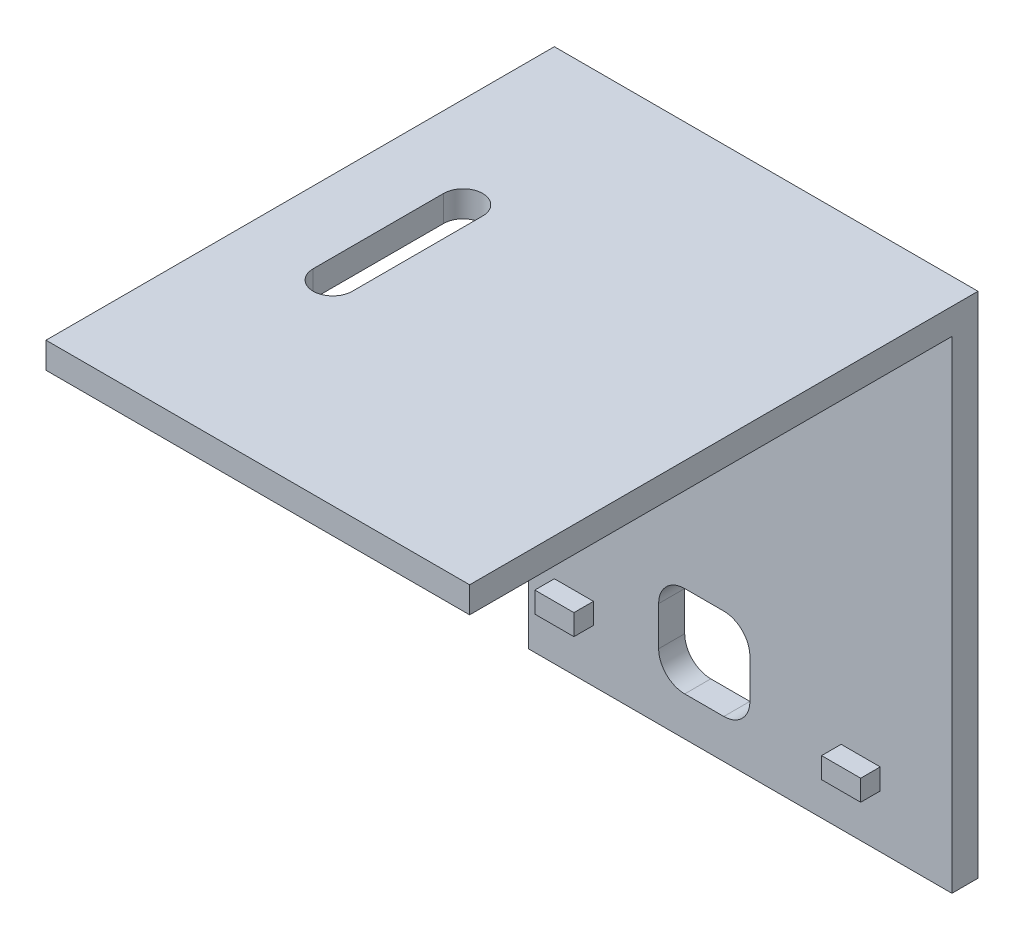
ISO-10303-21;
HEADER;
FILE_DESCRIPTION(('STEP AP214'),'2;1');
FILE_NAME('part.step','',(''),(''),'','','');
FILE_SCHEMA(('AUTOMOTIVE_DESIGN { 1 0 10303 214 1 1 1 1 }'));
ENDSEC;
DATA;
#1=APPLICATION_CONTEXT('core data for automotive mechanical design processes');
#2=APPLICATION_PROTOCOL_DEFINITION('international standard','automotive_design',2000,#1);
#3=PRODUCT_CONTEXT('',#1,'mechanical');
#4=PRODUCT('Part','Part','',(#3));
#5=PRODUCT_RELATED_PRODUCT_CATEGORY('part','',(#4));
#6=PRODUCT_DEFINITION_FORMATION('','',#4);
#7=PRODUCT_DEFINITION_CONTEXT('part definition',#1,'design');
#8=PRODUCT_DEFINITION('design','',#6,#7);
#9=PRODUCT_DEFINITION_SHAPE('','',#8);
#10=(LENGTH_UNIT() NAMED_UNIT(*) SI_UNIT(.MILLI.,.METRE.));
#11=(NAMED_UNIT(*) PLANE_ANGLE_UNIT() SI_UNIT($,.RADIAN.));
#12=(NAMED_UNIT(*) SI_UNIT($,.STERADIAN.) SOLID_ANGLE_UNIT());
#13=UNCERTAINTY_MEASURE_WITH_UNIT(LENGTH_MEASURE(1.E-05),#10,'distance_accuracy_value','');
#14=(GEOMETRIC_REPRESENTATION_CONTEXT(3) GLOBAL_UNCERTAINTY_ASSIGNED_CONTEXT((#13)) GLOBAL_UNIT_ASSIGNED_CONTEXT((#10,
#11,#12)) REPRESENTATION_CONTEXT('',''));
#15=CARTESIAN_POINT('',(0.,0.,0.));
#16=DIRECTION('',(0.,0.,1.));
#17=DIRECTION('',(1.,0.,0.));
#18=AXIS2_PLACEMENT_3D('',#15,#16,#17);
#19=CARTESIAN_POINT('',(0.,0.,2.));
#20=DIRECTION('',(0.,0.,-1.));
#21=DIRECTION('',(-1.,0.,0.));
#22=AXIS2_PLACEMENT_3D('',#19,#20,#21);
#23=PLANE('',#22);
#24=DIRECTION('',(0.,1.,0.));
#25=VECTOR('',#24,1.);
#26=CARTESIAN_POINT('',(-6.25000000000001,0.,2.));
#27=LINE('',#26,#25);
#28=CARTESIAN_POINT('',(-6.25,-13.5,2.));
#29=VERTEX_POINT('',#28);
#30=CARTESIAN_POINT('',(-6.25,-10.5,2.));
#31=VERTEX_POINT('',#30);
#32=EDGE_CURVE('E282',#29,#31,#27,.T.);
#33=ORIENTED_EDGE('',*,*,#32,.T.);
#34=CARTESIAN_POINT('',(-4.25,-10.5,2.));
#35=DIRECTION('',(0.,0.,-1.));
#36=DIRECTION('',(-1.,0.,0.));
#37=AXIS2_PLACEMENT_3D('',#34,#35,#36);
#38=CIRCLE('',#37,2.);
#39=CARTESIAN_POINT('',(-4.25,-8.50000000000001,2.));
#40=VERTEX_POINT('',#39);
#41=EDGE_CURVE('E409',#31,#40,#38,.T.);
#42=ORIENTED_EDGE('',*,*,#41,.T.);
#43=DIRECTION('',(1.,0.,0.));
#44=VECTOR('',#43,1.);
#45=CARTESIAN_POINT('',(0.,-8.50000000000001,2.));
#46=LINE('',#45,#44);
#47=CARTESIAN_POINT('',(-1.25,-8.50000000000001,2.));
#48=VERTEX_POINT('',#47);
#49=EDGE_CURVE('E285',#40,#48,#46,.T.);
#50=ORIENTED_EDGE('',*,*,#49,.T.);
#51=CARTESIAN_POINT('',(-1.25,-10.5,2.));
#52=DIRECTION('',(0.,0.,-1.));
#53=DIRECTION('',(-1.,0.,0.));
#54=AXIS2_PLACEMENT_3D('',#51,#52,#53);
#55=CIRCLE('',#54,2.);
#56=CARTESIAN_POINT('',(0.749999999999995,-10.5,2.));
#57=VERTEX_POINT('',#56);
#58=EDGE_CURVE('E11',#48,#57,#55,.T.);
#59=ORIENTED_EDGE('',*,*,#58,.T.);
#60=DIRECTION('',(0.,-1.,0.));
#61=VECTOR('',#60,1.);
#62=CARTESIAN_POINT('',(0.749999999999995,0.,2.));
#63=LINE('',#62,#61);
#64=CARTESIAN_POINT('',(0.749999999999995,-13.5,2.));
#65=VERTEX_POINT('',#64);
#66=EDGE_CURVE('E288',#57,#65,#63,.T.);
#67=ORIENTED_EDGE('',*,*,#66,.T.);
#68=CARTESIAN_POINT('',(-1.25,-13.5,2.));
#69=DIRECTION('',(0.,0.,-1.));
#70=DIRECTION('',(-1.,0.,0.));
#71=AXIS2_PLACEMENT_3D('',#68,#69,#70);
#72=CIRCLE('',#71,2.);
#73=CARTESIAN_POINT('',(-1.25,-15.5,2.));
#74=VERTEX_POINT('',#73);
#75=EDGE_CURVE('E405',#65,#74,#72,.T.);
#76=ORIENTED_EDGE('',*,*,#75,.T.);
#77=DIRECTION('',(-1.,0.,0.));
#78=VECTOR('',#77,1.);
#79=CARTESIAN_POINT('',(0.,-15.5,2.));
#80=LINE('',#79,#78);
#81=CARTESIAN_POINT('',(-4.25,-15.5,2.));
#82=VERTEX_POINT('',#81);
#83=EDGE_CURVE('E279',#74,#82,#80,.T.);
#84=ORIENTED_EDGE('',*,*,#83,.T.);
#85=CARTESIAN_POINT('',(-4.25,-13.5,2.));
#86=DIRECTION('',(0.,0.,-1.));
#87=DIRECTION('',(-1.,0.,0.));
#88=AXIS2_PLACEMENT_3D('',#85,#86,#87);
#89=CIRCLE('',#88,2.);
#90=EDGE_CURVE('E401',#82,#29,#89,.T.);
#91=ORIENTED_EDGE('',*,*,#90,.T.);
#92=EDGE_LOOP('',(#33,#42,#50,#59,#67,#76,#84,#91));
#93=FACE_BOUND('',#92,.T.);
#94=DIRECTION('',(0.,-1.,0.));
#95=VECTOR('',#94,1.);
#96=CARTESIAN_POINT('',(-14.25,-12.85,2.));
#97=LINE('',#96,#95);
#98=CARTESIAN_POINT('',(-14.25,-12.85,2.));
#99=VERTEX_POINT('',#98);
#100=CARTESIAN_POINT('',(-14.25,-14.45,2.));
#101=VERTEX_POINT('',#100);
#102=EDGE_CURVE('E324',#99,#101,#97,.T.);
#103=ORIENTED_EDGE('',*,*,#102,.F.);
#104=DIRECTION('',(-1.,0.,0.));
#105=VECTOR('',#104,1.);
#106=CARTESIAN_POINT('',(-14.25,-12.85,2.));
#107=LINE('',#106,#105);
#108=CARTESIAN_POINT('',(-11.25,-12.85,2.));
#109=VERTEX_POINT('',#108);
#110=EDGE_CURVE('E329',#109,#99,#107,.T.);
#111=ORIENTED_EDGE('',*,*,#110,.F.);
#112=DIRECTION('',(0.,1.,0.));
#113=VECTOR('',#112,1.);
#114=CARTESIAN_POINT('',(-11.25,-12.85,2.));
#115=LINE('',#114,#113);
#116=CARTESIAN_POINT('',(-11.25,-14.45,2.));
#117=VERTEX_POINT('',#116);
#118=EDGE_CURVE('E341',#117,#109,#115,.T.);
#119=ORIENTED_EDGE('',*,*,#118,.F.);
#120=DIRECTION('',(1.,0.,0.));
#121=VECTOR('',#120,1.);
#122=CARTESIAN_POINT('',(-14.25,-14.45,2.));
#123=LINE('',#122,#121);
#124=EDGE_CURVE('E338',#101,#117,#123,.T.);
#125=ORIENTED_EDGE('',*,*,#124,.F.);
#126=EDGE_LOOP('',(#103,#111,#119,#125));
#127=FACE_BOUND('',#126,.T.);
#128=DIRECTION('',(0.,1.,0.));
#129=VECTOR('',#128,1.);
#130=CARTESIAN_POINT('',(16.25,-18.5,2.));
#131=LINE('',#130,#129);
#132=CARTESIAN_POINT('',(16.25,-18.5,2.));
#133=VERTEX_POINT('',#132);
#134=CARTESIAN_POINT('',(16.25,18.5,2.));
#135=VERTEX_POINT('',#134);
#136=EDGE_CURVE('E358',#133,#135,#131,.T.);
#137=ORIENTED_EDGE('',*,*,#136,.T.);
#138=DIRECTION('',(-1.,0.,0.));
#139=VECTOR('',#138,1.);
#140=CARTESIAN_POINT('',(-16.25,18.5,2.));
#141=LINE('',#140,#139);
#142=CARTESIAN_POINT('',(-16.25,18.5,2.));
#143=VERTEX_POINT('',#142);
#144=EDGE_CURVE('E361',#135,#143,#141,.T.);
#145=ORIENTED_EDGE('',*,*,#144,.T.);
#146=DIRECTION('',(0.,-1.,0.));
#147=VECTOR('',#146,1.);
#148=CARTESIAN_POINT('',(-16.25,-18.5,2.));
#149=LINE('',#148,#147);
#150=CARTESIAN_POINT('',(-16.25,-18.5,2.));
#151=VERTEX_POINT('',#150);
#152=EDGE_CURVE('E365',#143,#151,#149,.T.);
#153=ORIENTED_EDGE('',*,*,#152,.T.);
#154=DIRECTION('',(1.,0.,0.));
#155=VECTOR('',#154,1.);
#156=CARTESIAN_POINT('',(-16.25,-18.5,2.));
#157=LINE('',#156,#155);
#158=EDGE_CURVE('E367',#151,#133,#157,.T.);
#159=ORIENTED_EDGE('',*,*,#158,.T.);
#160=EDGE_LOOP('',(#137,#145,#153,#159));
#161=FACE_BOUND('',#160,.T.);
#162=DIRECTION('',(0.,1.,0.));
#163=VECTOR('',#162,1.);
#164=CARTESIAN_POINT('',(10.75,-14.45,2.));
#165=LINE('',#164,#163);
#166=CARTESIAN_POINT('',(10.75,-14.45,2.));
#167=VERTEX_POINT('',#166);
#168=CARTESIAN_POINT('',(10.75,-12.85,2.));
#169=VERTEX_POINT('',#168);
#170=EDGE_CURVE('E291',#167,#169,#165,.T.);
#171=ORIENTED_EDGE('',*,*,#170,.F.);
#172=DIRECTION('',(1.,0.,0.));
#173=VECTOR('',#172,1.);
#174=CARTESIAN_POINT('',(7.75,-14.45,2.));
#175=LINE('',#174,#173);
#176=CARTESIAN_POINT('',(7.75,-14.45,2.));
#177=VERTEX_POINT('',#176);
#178=EDGE_CURVE('E296',#177,#167,#175,.T.);
#179=ORIENTED_EDGE('',*,*,#178,.F.);
#180=DIRECTION('',(0.,-1.,0.));
#181=VECTOR('',#180,1.);
#182=CARTESIAN_POINT('',(7.75,-14.45,2.));
#183=LINE('',#182,#181);
#184=CARTESIAN_POINT('',(7.75,-12.85,2.));
#185=VERTEX_POINT('',#184);
#186=EDGE_CURVE('E308',#185,#177,#183,.T.);
#187=ORIENTED_EDGE('',*,*,#186,.F.);
#188=DIRECTION('',(-1.,0.,0.));
#189=VECTOR('',#188,1.);
#190=CARTESIAN_POINT('',(7.75,-12.85,2.));
#191=LINE('',#190,#189);
#192=EDGE_CURVE('E305',#169,#185,#191,.T.);
#193=ORIENTED_EDGE('',*,*,#192,.F.);
#194=EDGE_LOOP('',(#171,#179,#187,#193));
#195=FACE_BOUND('',#194,.T.);
#196=ADVANCED_FACE('F35',(#93,#127,#161,#195),#23,.F.);
#197=CARTESIAN_POINT('',(16.25,-18.5,2.));
#198=DIRECTION('',(-1.,0.,0.));
#199=DIRECTION('',(0.,0.,1.));
#200=AXIS2_PLACEMENT_3D('',#197,#198,#199);
#201=PLANE('',#200);
#202=DIRECTION('',(0.,1.,0.));
#203=VECTOR('',#202,1.);
#204=CARTESIAN_POINT('',(16.25,-18.5,0.));
#205=LINE('',#204,#203);
#206=CARTESIAN_POINT('',(16.25,-18.5,0.));
#207=VERTEX_POINT('',#206);
#208=CARTESIAN_POINT('',(16.25,20.5,0.));
#209=VERTEX_POINT('',#208);
#210=EDGE_CURVE('E357',#207,#209,#205,.T.);
#211=ORIENTED_EDGE('',*,*,#210,.T.);
#212=DIRECTION('',(0.,0.,-1.));
#213=VECTOR('',#212,1.);
#214=CARTESIAN_POINT('',(16.25,20.5,0.));
#215=LINE('',#214,#213);
#216=CARTESIAN_POINT('',(16.25,20.5,39.));
#217=VERTEX_POINT('',#216);
#218=EDGE_CURVE('E250',#217,#209,#215,.T.);
#219=ORIENTED_EDGE('',*,*,#218,.F.);
#220=DIRECTION('',(0.,-1.,0.));
#221=VECTOR('',#220,1.);
#222=CARTESIAN_POINT('',(16.25,20.5,39.));
#223=LINE('',#222,#221);
#224=CARTESIAN_POINT('',(16.25,18.5,39.));
#225=VERTEX_POINT('',#224);
#226=EDGE_CURVE('E256',#217,#225,#223,.T.);
#227=ORIENTED_EDGE('',*,*,#226,.T.);
#228=DIRECTION('',(0.,0.,-1.));
#229=VECTOR('',#228,1.);
#230=CARTESIAN_POINT('',(16.25,18.5,0.));
#231=LINE('',#230,#229);
#232=EDGE_CURVE('E248',#225,#135,#231,.T.);
#233=ORIENTED_EDGE('',*,*,#232,.T.);
#234=ORIENTED_EDGE('',*,*,#136,.F.);
#235=DIRECTION('',(0.,0.,-1.));
#236=VECTOR('',#235,1.);
#237=CARTESIAN_POINT('',(16.25,-18.5,2.));
#238=LINE('',#237,#236);
#239=EDGE_CURVE('E369',#133,#207,#238,.T.);
#240=ORIENTED_EDGE('',*,*,#239,.T.);
#241=EDGE_LOOP('',(#211,#219,#227,#233,#234,#240));
#242=FACE_BOUND('',#241,.T.);
#243=ADVANCED_FACE('F458',(#242),#201,.F.);
#244=CARTESIAN_POINT('',(-16.25,-18.5,2.));
#245=DIRECTION('',(1.,0.,0.));
#246=DIRECTION('',(0.,0.,-1.));
#247=AXIS2_PLACEMENT_3D('',#244,#245,#246);
#248=PLANE('',#247);
#249=DIRECTION('',(0.,-1.,0.));
#250=VECTOR('',#249,1.);
#251=CARTESIAN_POINT('',(-16.25,-18.5,0.));
#252=LINE('',#251,#250);
#253=CARTESIAN_POINT('',(-16.25,20.5,0.));
#254=VERTEX_POINT('',#253);
#255=CARTESIAN_POINT('',(-16.25,-18.5,0.));
#256=VERTEX_POINT('',#255);
#257=EDGE_CURVE('E371',#254,#256,#252,.T.);
#258=ORIENTED_EDGE('',*,*,#257,.T.);
#259=DIRECTION('',(0.,0.,-1.));
#260=VECTOR('',#259,1.);
#261=CARTESIAN_POINT('',(-16.25,-18.5,2.));
#262=LINE('',#261,#260);
#263=EDGE_CURVE('E376',#151,#256,#262,.T.);
#264=ORIENTED_EDGE('',*,*,#263,.F.);
#265=ORIENTED_EDGE('',*,*,#152,.F.);
#266=DIRECTION('',(0.,0.,1.));
#267=VECTOR('',#266,1.);
#268=CARTESIAN_POINT('',(-16.25,18.5,0.));
#269=LINE('',#268,#267);
#270=CARTESIAN_POINT('',(-16.25,18.5,39.));
#271=VERTEX_POINT('',#270);
#272=EDGE_CURVE('E240',#143,#271,#269,.T.);
#273=ORIENTED_EDGE('',*,*,#272,.T.);
#274=DIRECTION('',(0.,-1.,0.));
#275=VECTOR('',#274,1.);
#276=CARTESIAN_POINT('',(-16.25,20.5,39.));
#277=LINE('',#276,#275);
#278=CARTESIAN_POINT('',(-16.25,20.5,39.));
#279=VERTEX_POINT('',#278);
#280=EDGE_CURVE('E264',#279,#271,#277,.T.);
#281=ORIENTED_EDGE('',*,*,#280,.F.);
#282=DIRECTION('',(0.,0.,1.));
#283=VECTOR('',#282,1.);
#284=CARTESIAN_POINT('',(-16.25,20.5,0.));
#285=LINE('',#284,#283);
#286=EDGE_CURVE('E244',#254,#279,#285,.T.);
#287=ORIENTED_EDGE('',*,*,#286,.F.);
#288=EDGE_LOOP('',(#258,#264,#265,#273,#281,#287));
#289=FACE_BOUND('',#288,.T.);
#290=ADVANCED_FACE('F463',(#289),#248,.F.);
#291=CARTESIAN_POINT('',(-16.25,-18.5,2.));
#292=DIRECTION('',(0.,1.,0.));
#293=DIRECTION('',(0.,0.,1.));
#294=AXIS2_PLACEMENT_3D('',#291,#292,#293);
#295=PLANE('',#294);
#296=DIRECTION('',(1.,0.,0.));
#297=VECTOR('',#296,1.);
#298=CARTESIAN_POINT('',(-16.25,-18.5,0.));
#299=LINE('',#298,#297);
#300=EDGE_CURVE('E362',#256,#207,#299,.T.);
#301=ORIENTED_EDGE('',*,*,#300,.T.);
#302=ORIENTED_EDGE('',*,*,#239,.F.);
#303=ORIENTED_EDGE('',*,*,#158,.F.);
#304=ORIENTED_EDGE('',*,*,#263,.T.);
#305=EDGE_LOOP('',(#301,#302,#303,#304));
#306=FACE_BOUND('',#305,.T.);
#307=ADVANCED_FACE('F472',(#306),#295,.F.);
#308=CARTESIAN_POINT('',(0.,0.,0.));
#309=DIRECTION('',(0.,0.,-1.));
#310=DIRECTION('',(-1.,0.,0.));
#311=AXIS2_PLACEMENT_3D('',#308,#309,#310);
#312=PLANE('',#311);
#313=DIRECTION('',(0.,-1.,0.));
#314=VECTOR('',#313,1.);
#315=CARTESIAN_POINT('',(0.749999999999995,-15.5,0.));
#316=LINE('',#315,#314);
#317=CARTESIAN_POINT('',(0.749999999999995,-10.5,0.));
#318=VERTEX_POINT('',#317);
#319=CARTESIAN_POINT('',(0.749999999999995,-13.5,0.));
#320=VERTEX_POINT('',#319);
#321=EDGE_CURVE('E267',#318,#320,#316,.T.);
#322=ORIENTED_EDGE('',*,*,#321,.F.);
#323=CARTESIAN_POINT('',(-1.25,-10.5,0.));
#324=DIRECTION('',(0.,0.,-1.));
#325=DIRECTION('',(-1.,0.,0.));
#326=AXIS2_PLACEMENT_3D('',#323,#324,#325);
#327=CIRCLE('',#326,2.);
#328=CARTESIAN_POINT('',(-1.25,-8.50000000000001,0.));
#329=VERTEX_POINT('',#328);
#330=EDGE_CURVE('E43',#318,#329,#327,.F.);
#331=ORIENTED_EDGE('',*,*,#330,.T.);
#332=DIRECTION('',(1.,0.,0.));
#333=VECTOR('',#332,1.);
#334=CARTESIAN_POINT('',(0.749999999999995,-8.50000000000001,0.));
#335=LINE('',#334,#333);
#336=CARTESIAN_POINT('',(-4.25,-8.50000000000001,0.));
#337=VERTEX_POINT('',#336);
#338=EDGE_CURVE('E276',#337,#329,#335,.T.);
#339=ORIENTED_EDGE('',*,*,#338,.F.);
#340=CARTESIAN_POINT('',(-4.25,-10.5,0.));
#341=DIRECTION('',(0.,0.,-1.));
#342=DIRECTION('',(-1.,0.,0.));
#343=AXIS2_PLACEMENT_3D('',#340,#341,#342);
#344=CIRCLE('',#343,2.);
#345=CARTESIAN_POINT('',(-6.25,-10.5,0.));
#346=VERTEX_POINT('',#345);
#347=EDGE_CURVE('E407',#337,#346,#344,.F.);
#348=ORIENTED_EDGE('',*,*,#347,.T.);
#349=DIRECTION('',(0.,1.,0.));
#350=VECTOR('',#349,1.);
#351=CARTESIAN_POINT('',(-6.25,-15.5,0.));
#352=LINE('',#351,#350);
#353=CARTESIAN_POINT('',(-6.25,-13.5,0.));
#354=VERTEX_POINT('',#353);
#355=EDGE_CURVE('E273',#354,#346,#352,.T.);
#356=ORIENTED_EDGE('',*,*,#355,.F.);
#357=CARTESIAN_POINT('',(-4.25,-13.5,0.));
#358=DIRECTION('',(0.,0.,-1.));
#359=DIRECTION('',(-1.,0.,0.));
#360=AXIS2_PLACEMENT_3D('',#357,#358,#359);
#361=CIRCLE('',#360,2.);
#362=CARTESIAN_POINT('',(-4.25,-15.5,0.));
#363=VERTEX_POINT('',#362);
#364=EDGE_CURVE('E399',#354,#363,#361,.F.);
#365=ORIENTED_EDGE('',*,*,#364,.T.);
#366=DIRECTION('',(-1.,0.,0.));
#367=VECTOR('',#366,1.);
#368=CARTESIAN_POINT('',(0.749999999999995,-15.5,0.));
#369=LINE('',#368,#367);
#370=CARTESIAN_POINT('',(-1.25,-15.5,0.));
#371=VERTEX_POINT('',#370);
#372=EDGE_CURVE('E270',#371,#363,#369,.T.);
#373=ORIENTED_EDGE('',*,*,#372,.F.);
#374=CARTESIAN_POINT('',(-1.25,-13.5,0.));
#375=DIRECTION('',(0.,0.,-1.));
#376=DIRECTION('',(-1.,0.,0.));
#377=AXIS2_PLACEMENT_3D('',#374,#375,#376);
#378=CIRCLE('',#377,2.);
#379=EDGE_CURVE('E403',#371,#320,#378,.F.);
#380=ORIENTED_EDGE('',*,*,#379,.T.);
#381=EDGE_LOOP('',(#322,#331,#339,#348,#356,#365,#373,#380));
#382=FACE_BOUND('',#381,.T.);
#383=ORIENTED_EDGE('',*,*,#210,.F.);
#384=ORIENTED_EDGE('',*,*,#300,.F.);
#385=ORIENTED_EDGE('',*,*,#257,.F.);
#386=DIRECTION('',(-1.,0.,0.));
#387=VECTOR('',#386,1.);
#388=CARTESIAN_POINT('',(-16.25,20.5,0.));
#389=LINE('',#388,#387);
#390=EDGE_CURVE('E253',#209,#254,#389,.T.);
#391=ORIENTED_EDGE('',*,*,#390,.F.);
#392=EDGE_LOOP('',(#383,#384,#385,#391));
#393=FACE_BOUND('',#392,.T.);
#394=ADVANCED_FACE('F413',(#382,#393),#312,.T.);
#395=CARTESIAN_POINT('',(-14.25,-12.85,3.5));
#396=DIRECTION('',(1.,0.,0.));
#397=DIRECTION('',(0.,0.,-1.));
#398=AXIS2_PLACEMENT_3D('',#395,#396,#397);
#399=PLANE('',#398);
#400=ORIENTED_EDGE('',*,*,#102,.T.);
#401=DIRECTION('',(0.,0.,-1.));
#402=VECTOR('',#401,1.);
#403=CARTESIAN_POINT('',(-14.25,-14.45,3.5));
#404=LINE('',#403,#402);
#405=CARTESIAN_POINT('',(-14.25,-14.45,3.5));
#406=VERTEX_POINT('',#405);
#407=EDGE_CURVE('E354',#406,#101,#404,.T.);
#408=ORIENTED_EDGE('',*,*,#407,.F.);
#409=DIRECTION('',(0.,-1.,0.));
#410=VECTOR('',#409,1.);
#411=CARTESIAN_POINT('',(-14.25,-12.85,3.5));
#412=LINE('',#411,#410);
#413=CARTESIAN_POINT('',(-14.25,-12.85,3.5));
#414=VERTEX_POINT('',#413);
#415=EDGE_CURVE('E325',#414,#406,#412,.T.);
#416=ORIENTED_EDGE('',*,*,#415,.F.);
#417=DIRECTION('',(0.,0.,-1.));
#418=VECTOR('',#417,1.);
#419=CARTESIAN_POINT('',(-14.25,-12.85,3.5));
#420=LINE('',#419,#418);
#421=EDGE_CURVE('E335',#414,#99,#420,.T.);
#422=ORIENTED_EDGE('',*,*,#421,.T.);
#423=EDGE_LOOP('',(#400,#408,#416,#422));
#424=FACE_BOUND('',#423,.T.);
#425=ADVANCED_FACE('F468',(#424),#399,.F.);
#426=CARTESIAN_POINT('',(-14.25,-14.45,3.5));
#427=DIRECTION('',(0.,1.,0.));
#428=DIRECTION('',(0.,0.,1.));
#429=AXIS2_PLACEMENT_3D('',#426,#427,#428);
#430=PLANE('',#429);
#431=ORIENTED_EDGE('',*,*,#124,.T.);
#432=DIRECTION('',(0.,0.,-1.));
#433=VECTOR('',#432,1.);
#434=CARTESIAN_POINT('',(-11.25,-14.45,3.5));
#435=LINE('',#434,#433);
#436=CARTESIAN_POINT('',(-11.25,-14.45,3.5));
#437=VERTEX_POINT('',#436);
#438=EDGE_CURVE('E351',#437,#117,#435,.T.);
#439=ORIENTED_EDGE('',*,*,#438,.F.);
#440=DIRECTION('',(1.,0.,0.));
#441=VECTOR('',#440,1.);
#442=CARTESIAN_POINT('',(-14.25,-14.45,3.5));
#443=LINE('',#442,#441);
#444=EDGE_CURVE('E328',#406,#437,#443,.T.);
#445=ORIENTED_EDGE('',*,*,#444,.F.);
#446=ORIENTED_EDGE('',*,*,#407,.T.);
#447=EDGE_LOOP('',(#431,#439,#445,#446));
#448=FACE_BOUND('',#447,.T.);
#449=ADVANCED_FACE('F522',(#448),#430,.F.);
#450=CARTESIAN_POINT('',(-11.25,-12.85,3.5));
#451=DIRECTION('',(-1.,0.,0.));
#452=DIRECTION('',(0.,-1.,0.));
#453=AXIS2_PLACEMENT_3D('',#450,#451,#452);
#454=PLANE('',#453);
#455=ORIENTED_EDGE('',*,*,#118,.T.);
#456=DIRECTION('',(0.,0.,-1.));
#457=VECTOR('',#456,1.);
#458=CARTESIAN_POINT('',(-11.25,-12.85,3.5));
#459=LINE('',#458,#457);
#460=CARTESIAN_POINT('',(-11.25,-12.85,3.5));
#461=VERTEX_POINT('',#460);
#462=EDGE_CURVE('E348',#461,#109,#459,.T.);
#463=ORIENTED_EDGE('',*,*,#462,.F.);
#464=DIRECTION('',(0.,1.,0.));
#465=VECTOR('',#464,1.);
#466=CARTESIAN_POINT('',(-11.25,-12.85,3.5));
#467=LINE('',#466,#465);
#468=EDGE_CURVE('E331',#437,#461,#467,.T.);
#469=ORIENTED_EDGE('',*,*,#468,.F.);
#470=ORIENTED_EDGE('',*,*,#438,.T.);
#471=EDGE_LOOP('',(#455,#463,#469,#470));
#472=FACE_BOUND('',#471,.T.);
#473=ADVANCED_FACE('F519',(#472),#454,.F.);
#474=CARTESIAN_POINT('',(-14.25,-12.85,3.5));
#475=DIRECTION('',(0.,-1.,0.));
#476=DIRECTION('',(1.,0.,0.));
#477=AXIS2_PLACEMENT_3D('',#474,#475,#476);
#478=PLANE('',#477);
#479=ORIENTED_EDGE('',*,*,#110,.T.);
#480=ORIENTED_EDGE('',*,*,#421,.F.);
#481=DIRECTION('',(-1.,0.,0.));
#482=VECTOR('',#481,1.);
#483=CARTESIAN_POINT('',(-14.25,-12.85,3.5));
#484=LINE('',#483,#482);
#485=EDGE_CURVE('E333',#461,#414,#484,.T.);
#486=ORIENTED_EDGE('',*,*,#485,.F.);
#487=ORIENTED_EDGE('',*,*,#462,.T.);
#488=EDGE_LOOP('',(#479,#480,#486,#487));
#489=FACE_BOUND('',#488,.T.);
#490=ADVANCED_FACE('F515',(#489),#478,.F.);
#491=CARTESIAN_POINT('',(0.,0.,3.5));
#492=DIRECTION('',(0.,0.,1.));
#493=DIRECTION('',(1.,0.,0.));
#494=AXIS2_PLACEMENT_3D('',#491,#492,#493);
#495=PLANE('',#494);
#496=ORIENTED_EDGE('',*,*,#415,.T.);
#497=ORIENTED_EDGE('',*,*,#444,.T.);
#498=ORIENTED_EDGE('',*,*,#468,.T.);
#499=ORIENTED_EDGE('',*,*,#485,.T.);
#500=EDGE_LOOP('',(#496,#497,#498,#499));
#501=FACE_BOUND('',#500,.T.);
#502=ADVANCED_FACE('F511',(#501),#495,.T.);
#503=CARTESIAN_POINT('',(10.75,-14.45,3.5));
#504=DIRECTION('',(-1.,0.,0.));
#505=DIRECTION('',(0.,0.,1.));
#506=AXIS2_PLACEMENT_3D('',#503,#504,#505);
#507=PLANE('',#506);
#508=ORIENTED_EDGE('',*,*,#170,.T.);
#509=DIRECTION('',(0.,0.,-1.));
#510=VECTOR('',#509,1.);
#511=CARTESIAN_POINT('',(10.75,-12.85,3.5));
#512=LINE('',#511,#510);
#513=CARTESIAN_POINT('',(10.75,-12.85,3.5));
#514=VERTEX_POINT('',#513);
#515=EDGE_CURVE('E321',#514,#169,#512,.T.);
#516=ORIENTED_EDGE('',*,*,#515,.F.);
#517=DIRECTION('',(0.,1.,0.));
#518=VECTOR('',#517,1.);
#519=CARTESIAN_POINT('',(10.75,-14.45,3.5));
#520=LINE('',#519,#518);
#521=CARTESIAN_POINT('',(10.75,-14.45,3.5));
#522=VERTEX_POINT('',#521);
#523=EDGE_CURVE('E292',#522,#514,#520,.T.);
#524=ORIENTED_EDGE('',*,*,#523,.F.);
#525=DIRECTION('',(0.,0.,-1.));
#526=VECTOR('',#525,1.);
#527=CARTESIAN_POINT('',(10.75,-14.45,3.5));
#528=LINE('',#527,#526);
#529=EDGE_CURVE('E302',#522,#167,#528,.T.);
#530=ORIENTED_EDGE('',*,*,#529,.T.);
#531=EDGE_LOOP('',(#508,#516,#524,#530));
#532=FACE_BOUND('',#531,.T.);
#533=ADVANCED_FACE('F507',(#532),#507,.F.);
#534=CARTESIAN_POINT('',(7.75,-12.85,3.5));
#535=DIRECTION('',(0.,-1.,0.));
#536=DIRECTION('',(0.,0.,-1.));
#537=AXIS2_PLACEMENT_3D('',#534,#535,#536);
#538=PLANE('',#537);
#539=ORIENTED_EDGE('',*,*,#192,.T.);
#540=DIRECTION('',(0.,0.,-1.));
#541=VECTOR('',#540,1.);
#542=CARTESIAN_POINT('',(7.75,-12.85,3.5));
#543=LINE('',#542,#541);
#544=CARTESIAN_POINT('',(7.75,-12.85,3.5));
#545=VERTEX_POINT('',#544);
#546=EDGE_CURVE('E318',#545,#185,#543,.T.);
#547=ORIENTED_EDGE('',*,*,#546,.F.);
#548=DIRECTION('',(-1.,0.,0.));
#549=VECTOR('',#548,1.);
#550=CARTESIAN_POINT('',(7.75,-12.85,3.5));
#551=LINE('',#550,#549);
#552=EDGE_CURVE('E295',#514,#545,#551,.T.);
#553=ORIENTED_EDGE('',*,*,#552,.F.);
#554=ORIENTED_EDGE('',*,*,#515,.T.);
#555=EDGE_LOOP('',(#539,#547,#553,#554));
#556=FACE_BOUND('',#555,.T.);
#557=ADVANCED_FACE('F503',(#556),#538,.F.);
#558=CARTESIAN_POINT('',(7.75,-14.45,3.5));
#559=DIRECTION('',(1.,0.,0.));
#560=DIRECTION('',(0.,0.,-1.));
#561=AXIS2_PLACEMENT_3D('',#558,#559,#560);
#562=PLANE('',#561);
#563=ORIENTED_EDGE('',*,*,#186,.T.);
#564=DIRECTION('',(0.,0.,-1.));
#565=VECTOR('',#564,1.);
#566=CARTESIAN_POINT('',(7.75,-14.45,3.5));
#567=LINE('',#566,#565);
#568=CARTESIAN_POINT('',(7.75,-14.45,3.5));
#569=VERTEX_POINT('',#568);
#570=EDGE_CURVE('E315',#569,#177,#567,.T.);
#571=ORIENTED_EDGE('',*,*,#570,.F.);
#572=DIRECTION('',(0.,-1.,0.));
#573=VECTOR('',#572,1.);
#574=CARTESIAN_POINT('',(7.75,-14.45,3.5));
#575=LINE('',#574,#573);
#576=EDGE_CURVE('E298',#545,#569,#575,.T.);
#577=ORIENTED_EDGE('',*,*,#576,.F.);
#578=ORIENTED_EDGE('',*,*,#546,.T.);
#579=EDGE_LOOP('',(#563,#571,#577,#578));
#580=FACE_BOUND('',#579,.T.);
#581=ADVANCED_FACE('F499',(#580),#562,.F.);
#582=CARTESIAN_POINT('',(7.75,-14.45,3.5));
#583=DIRECTION('',(0.,1.,0.));
#584=DIRECTION('',(0.,0.,1.));
#585=AXIS2_PLACEMENT_3D('',#582,#583,#584);
#586=PLANE('',#585);
#587=ORIENTED_EDGE('',*,*,#178,.T.);
#588=ORIENTED_EDGE('',*,*,#529,.F.);
#589=DIRECTION('',(1.,0.,0.));
#590=VECTOR('',#589,1.);
#591=CARTESIAN_POINT('',(7.75,-14.45,3.5));
#592=LINE('',#591,#590);
#593=EDGE_CURVE('E300',#569,#522,#592,.T.);
#594=ORIENTED_EDGE('',*,*,#593,.F.);
#595=ORIENTED_EDGE('',*,*,#570,.T.);
#596=EDGE_LOOP('',(#587,#588,#594,#595));
#597=FACE_BOUND('',#596,.T.);
#598=ADVANCED_FACE('F495',(#597),#586,.F.);
#599=CARTESIAN_POINT('',(0.,0.,3.5));
#600=DIRECTION('',(0.,0.,-1.));
#601=DIRECTION('',(-1.,0.,0.));
#602=AXIS2_PLACEMENT_3D('',#599,#600,#601);
#603=PLANE('',#602);
#604=ORIENTED_EDGE('',*,*,#523,.T.);
#605=ORIENTED_EDGE('',*,*,#552,.T.);
#606=ORIENTED_EDGE('',*,*,#576,.T.);
#607=ORIENTED_EDGE('',*,*,#593,.T.);
#608=EDGE_LOOP('',(#604,#605,#606,#607));
#609=FACE_BOUND('',#608,.T.);
#610=ADVANCED_FACE('F492',(#609),#603,.F.);
#611=CARTESIAN_POINT('',(0.749999999999995,-15.5,3.5));
#612=DIRECTION('',(1.,0.,0.));
#613=DIRECTION('',(0.,0.,-1.));
#614=AXIS2_PLACEMENT_3D('',#611,#612,#613);
#615=PLANE('',#614);
#616=ORIENTED_EDGE('',*,*,#321,.T.);
#617=DIRECTION('',(0.,0.,-1.));
#618=VECTOR('',#617,1.);
#619=CARTESIAN_POINT('',(0.749999999999995,-13.5,2.));
#620=LINE('',#619,#618);
#621=EDGE_CURVE('E392',#320,#65,#620,.F.);
#622=ORIENTED_EDGE('',*,*,#621,.T.);
#623=ORIENTED_EDGE('',*,*,#66,.F.);
#624=DIRECTION('',(0.,0.,-1.));
#625=VECTOR('',#624,1.);
#626=CARTESIAN_POINT('',(0.749999999999995,-10.5,0.));
#627=LINE('',#626,#625);
#628=EDGE_CURVE('E389',#57,#318,#627,.T.);
#629=ORIENTED_EDGE('',*,*,#628,.T.);
#630=EDGE_LOOP('',(#616,#622,#623,#629));
#631=FACE_BOUND('',#630,.T.);
#632=ADVANCED_FACE('F428',(#631),#615,.F.);
#633=CARTESIAN_POINT('',(0.749999999999995,-8.50000000000001,3.5));
#634=DIRECTION('',(0.,1.,0.));
#635=DIRECTION('',(0.,0.,1.));
#636=AXIS2_PLACEMENT_3D('',#633,#634,#635);
#637=PLANE('',#636);
#638=ORIENTED_EDGE('',*,*,#49,.F.);
#639=DIRECTION('',(0.,0.,-1.));
#640=VECTOR('',#639,1.);
#641=CARTESIAN_POINT('',(-4.25,-8.50000000000001,0.));
#642=LINE('',#641,#640);
#643=EDGE_CURVE('E396',#40,#337,#642,.T.);
#644=ORIENTED_EDGE('',*,*,#643,.T.);
#645=ORIENTED_EDGE('',*,*,#338,.T.);
#646=DIRECTION('',(0.,0.,-1.));
#647=VECTOR('',#646,1.);
#648=CARTESIAN_POINT('',(-1.25,-8.50000000000001,2.));
#649=LINE('',#648,#647);
#650=EDGE_CURVE('E394',#329,#48,#649,.F.);
#651=ORIENTED_EDGE('',*,*,#650,.T.);
#652=EDGE_LOOP('',(#638,#644,#645,#651));
#653=FACE_BOUND('',#652,.T.);
#654=ADVANCED_FACE('F420',(#653),#637,.F.);
#655=CARTESIAN_POINT('',(-6.25,-15.5,3.5));
#656=DIRECTION('',(-1.,0.,0.));
#657=DIRECTION('',(0.,-1.,0.));
#658=AXIS2_PLACEMENT_3D('',#655,#656,#657);
#659=PLANE('',#658);
#660=ORIENTED_EDGE('',*,*,#32,.F.);
#661=DIRECTION('',(0.,0.,-1.));
#662=VECTOR('',#661,1.);
#663=CARTESIAN_POINT('',(-6.25,-13.5,0.));
#664=LINE('',#663,#662);
#665=EDGE_CURVE('E381',#29,#354,#664,.T.);
#666=ORIENTED_EDGE('',*,*,#665,.T.);
#667=ORIENTED_EDGE('',*,*,#355,.T.);
#668=DIRECTION('',(0.,0.,-1.));
#669=VECTOR('',#668,1.);
#670=CARTESIAN_POINT('',(-6.25,-10.5,2.));
#671=LINE('',#670,#669);
#672=EDGE_CURVE('E379',#346,#31,#671,.F.);
#673=ORIENTED_EDGE('',*,*,#672,.T.);
#674=EDGE_LOOP('',(#660,#666,#667,#673));
#675=FACE_BOUND('',#674,.T.);
#676=ADVANCED_FACE('F445',(#675),#659,.F.);
#677=CARTESIAN_POINT('',(0.749999999999995,-15.5,3.5));
#678=DIRECTION('',(0.,-1.,0.));
#679=DIRECTION('',(1.,0.,0.));
#680=AXIS2_PLACEMENT_3D('',#677,#678,#679);
#681=PLANE('',#680);
#682=ORIENTED_EDGE('',*,*,#372,.T.);
#683=DIRECTION('',(0.,0.,-1.));
#684=VECTOR('',#683,1.);
#685=CARTESIAN_POINT('',(-4.25,-15.5,2.));
#686=LINE('',#685,#684);
#687=EDGE_CURVE('E387',#363,#82,#686,.F.);
#688=ORIENTED_EDGE('',*,*,#687,.T.);
#689=ORIENTED_EDGE('',*,*,#83,.F.);
#690=DIRECTION('',(0.,0.,-1.));
#691=VECTOR('',#690,1.);
#692=CARTESIAN_POINT('',(-1.25,-15.5,0.));
#693=LINE('',#692,#691);
#694=EDGE_CURVE('E384',#74,#371,#693,.T.);
#695=ORIENTED_EDGE('',*,*,#694,.T.);
#696=EDGE_LOOP('',(#682,#688,#689,#695));
#697=FACE_BOUND('',#696,.T.);
#698=ADVANCED_FACE('F436',(#697),#681,.F.);
#699=CARTESIAN_POINT('',(-4.25,-13.5,3.5));
#700=DIRECTION('',(0.,0.,1.));
#701=DIRECTION('',(1.,0.,0.));
#702=AXIS2_PLACEMENT_3D('',#699,#700,#701);
#703=CYLINDRICAL_SURFACE('',#702,2.);
#704=ORIENTED_EDGE('',*,*,#90,.F.);
#705=ORIENTED_EDGE('',*,*,#687,.F.);
#706=ORIENTED_EDGE('',*,*,#364,.F.);
#707=ORIENTED_EDGE('',*,*,#665,.F.);
#708=EDGE_LOOP('',(#704,#705,#706,#707));
#709=FACE_BOUND('',#708,.T.);
#710=ADVANCED_FACE('F440',(#709),#703,.F.);
#711=CARTESIAN_POINT('',(-1.25,-13.5,3.5));
#712=DIRECTION('',(0.,0.,1.));
#713=DIRECTION('',(1.,0.,0.));
#714=AXIS2_PLACEMENT_3D('',#711,#712,#713);
#715=CYLINDRICAL_SURFACE('',#714,2.);
#716=ORIENTED_EDGE('',*,*,#75,.F.);
#717=ORIENTED_EDGE('',*,*,#621,.F.);
#718=ORIENTED_EDGE('',*,*,#379,.F.);
#719=ORIENTED_EDGE('',*,*,#694,.F.);
#720=EDGE_LOOP('',(#716,#717,#718,#719));
#721=FACE_BOUND('',#720,.T.);
#722=ADVANCED_FACE('F431',(#721),#715,.F.);
#723=CARTESIAN_POINT('',(-4.25,-10.5,3.5));
#724=DIRECTION('',(0.,0.,1.));
#725=DIRECTION('',(1.,0.,0.));
#726=AXIS2_PLACEMENT_3D('',#723,#724,#725);
#727=CYLINDRICAL_SURFACE('',#726,2.);
#728=ORIENTED_EDGE('',*,*,#41,.F.);
#729=ORIENTED_EDGE('',*,*,#672,.F.);
#730=ORIENTED_EDGE('',*,*,#347,.F.);
#731=ORIENTED_EDGE('',*,*,#643,.F.);
#732=EDGE_LOOP('',(#728,#729,#730,#731));
#733=FACE_BOUND('',#732,.T.);
#734=ADVANCED_FACE('F449',(#733),#727,.F.);
#735=CARTESIAN_POINT('',(-1.25,-10.5,3.5));
#736=DIRECTION('',(0.,0.,1.));
#737=DIRECTION('',(1.,0.,0.));
#738=AXIS2_PLACEMENT_3D('',#735,#736,#737);
#739=CYLINDRICAL_SURFACE('',#738,2.);
#740=ORIENTED_EDGE('',*,*,#58,.F.);
#741=ORIENTED_EDGE('',*,*,#650,.F.);
#742=ORIENTED_EDGE('',*,*,#330,.F.);
#743=ORIENTED_EDGE('',*,*,#628,.F.);
#744=EDGE_LOOP('',(#740,#741,#742,#743));
#745=FACE_BOUND('',#744,.T.);
#746=ADVANCED_FACE('F37',(#745),#739,.F.);
#747=CARTESIAN_POINT('',(-16.25,20.5,39.));
#748=DIRECTION('',(0.,0.,-1.));
#749=DIRECTION('',(-1.,0.,0.));
#750=AXIS2_PLACEMENT_3D('',#747,#748,#749);
#751=PLANE('',#750);
#752=DIRECTION('',(1.,0.,0.));
#753=VECTOR('',#752,1.);
#754=CARTESIAN_POINT('',(-16.25,18.5,39.));
#755=LINE('',#754,#753);
#756=EDGE_CURVE('E258',#271,#225,#755,.T.);
#757=ORIENTED_EDGE('',*,*,#756,.T.);
#758=ORIENTED_EDGE('',*,*,#226,.F.);
#759=DIRECTION('',(1.,0.,0.));
#760=VECTOR('',#759,1.);
#761=CARTESIAN_POINT('',(-16.25,20.5,39.));
#762=LINE('',#761,#760);
#763=EDGE_CURVE('E247',#279,#217,#762,.T.);
#764=ORIENTED_EDGE('',*,*,#763,.F.);
#765=ORIENTED_EDGE('',*,*,#280,.T.);
#766=EDGE_LOOP('',(#757,#758,#764,#765));
#767=FACE_BOUND('',#766,.T.);
#768=ADVANCED_FACE('F455',(#767),#751,.F.);
#769=CARTESIAN_POINT('',(0.,20.5,0.));
#770=DIRECTION('',(0.,1.,0.));
#771=DIRECTION('',(0.,0.,1.));
#772=AXIS2_PLACEMENT_3D('',#769,#770,#771);
#773=PLANE('',#772);
#774=CARTESIAN_POINT('',(-9.25,20.5,24.));
#775=DIRECTION('',(0.,1.,0.));
#776=DIRECTION('',(0.,0.,1.));
#777=AXIS2_PLACEMENT_3D('',#774,#775,#776);
#778=CIRCLE('',#777,1.5);
#779=CARTESIAN_POINT('',(-10.75,20.5,24.));
#780=VERTEX_POINT('',#779);
#781=CARTESIAN_POINT('',(-7.75,20.5,24.));
#782=VERTEX_POINT('',#781);
#783=EDGE_CURVE('E50',#780,#782,#778,.T.);
#784=ORIENTED_EDGE('',*,*,#783,.F.);
#785=DIRECTION('',(0.,0.,1.));
#786=VECTOR('',#785,1.);
#787=CARTESIAN_POINT('',(-10.75,20.5,24.));
#788=LINE('',#787,#786);
#789=CARTESIAN_POINT('',(-10.75,20.5,14.));
#790=VERTEX_POINT('',#789);
#791=EDGE_CURVE('E225',#790,#780,#788,.T.);
#792=ORIENTED_EDGE('',*,*,#791,.F.);
#793=CARTESIAN_POINT('',(-9.25,20.5,14.));
#794=DIRECTION('',(0.,1.,0.));
#795=DIRECTION('',(0.,0.,1.));
#796=AXIS2_PLACEMENT_3D('',#793,#794,#795);
#797=CIRCLE('',#796,1.5);
#798=CARTESIAN_POINT('',(-7.75,20.5,14.));
#799=VERTEX_POINT('',#798);
#800=EDGE_CURVE('E228',#799,#790,#797,.T.);
#801=ORIENTED_EDGE('',*,*,#800,.F.);
#802=DIRECTION('',(0.,0.,-1.));
#803=VECTOR('',#802,1.);
#804=CARTESIAN_POINT('',(-7.75,20.5,24.));
#805=LINE('',#804,#803);
#806=EDGE_CURVE('E234',#782,#799,#805,.T.);
#807=ORIENTED_EDGE('',*,*,#806,.F.);
#808=EDGE_LOOP('',(#784,#792,#801,#807));
#809=FACE_BOUND('',#808,.T.);
#810=ORIENTED_EDGE('',*,*,#286,.T.);
#811=ORIENTED_EDGE('',*,*,#763,.T.);
#812=ORIENTED_EDGE('',*,*,#218,.T.);
#813=ORIENTED_EDGE('',*,*,#390,.T.);
#814=EDGE_LOOP('',(#810,#811,#812,#813));
#815=FACE_BOUND('',#814,.T.);
#816=ADVANCED_FACE('F561',(#809,#815),#773,.T.);
#817=CARTESIAN_POINT('',(0.,18.5,0.));
#818=DIRECTION('',(0.,1.,0.));
#819=DIRECTION('',(0.,0.,1.));
#820=AXIS2_PLACEMENT_3D('',#817,#818,#819);
#821=PLANE('',#820);
#822=DIRECTION('',(0.,0.,1.));
#823=VECTOR('',#822,1.);
#824=CARTESIAN_POINT('',(-10.75,18.5,24.));
#825=LINE('',#824,#823);
#826=CARTESIAN_POINT('',(-10.75,18.5,14.));
#827=VERTEX_POINT('',#826);
#828=CARTESIAN_POINT('',(-10.75,18.5,24.));
#829=VERTEX_POINT('',#828);
#830=EDGE_CURVE('E215',#827,#829,#825,.T.);
#831=ORIENTED_EDGE('',*,*,#830,.T.);
#832=CARTESIAN_POINT('',(-9.25,18.5,24.));
#833=DIRECTION('',(0.,1.,0.));
#834=DIRECTION('',(0.,0.,1.));
#835=AXIS2_PLACEMENT_3D('',#832,#833,#834);
#836=CIRCLE('',#835,1.5);
#837=CARTESIAN_POINT('',(-7.75,18.5,24.));
#838=VERTEX_POINT('',#837);
#839=EDGE_CURVE('E209',#829,#838,#836,.T.);
#840=ORIENTED_EDGE('',*,*,#839,.T.);
#841=DIRECTION('',(0.,0.,-1.));
#842=VECTOR('',#841,1.);
#843=CARTESIAN_POINT('',(-7.75,18.5,24.));
#844=LINE('',#843,#842);
#845=CARTESIAN_POINT('',(-7.75,18.5,14.));
#846=VERTEX_POINT('',#845);
#847=EDGE_CURVE('E218',#838,#846,#844,.T.);
#848=ORIENTED_EDGE('',*,*,#847,.T.);
#849=CARTESIAN_POINT('',(-9.25,18.5,14.));
#850=DIRECTION('',(0.,1.,0.));
#851=DIRECTION('',(0.,0.,1.));
#852=AXIS2_PLACEMENT_3D('',#849,#850,#851);
#853=CIRCLE('',#852,1.5);
#854=EDGE_CURVE('E58',#846,#827,#853,.T.);
#855=ORIENTED_EDGE('',*,*,#854,.T.);
#856=EDGE_LOOP('',(#831,#840,#848,#855));
#857=FACE_BOUND('',#856,.T.);
#858=ORIENTED_EDGE('',*,*,#144,.F.);
#859=ORIENTED_EDGE('',*,*,#232,.F.);
#860=ORIENTED_EDGE('',*,*,#756,.F.);
#861=ORIENTED_EDGE('',*,*,#272,.F.);
#862=EDGE_LOOP('',(#858,#859,#860,#861));
#863=FACE_BOUND('',#862,.T.);
#864=ADVANCED_FACE('F222',(#857,#863),#821,.F.);
#865=CARTESIAN_POINT('',(-9.25,18.5,24.));
#866=DIRECTION('',(0.,1.,0.));
#867=DIRECTION('',(0.,0.,1.));
#868=AXIS2_PLACEMENT_3D('',#865,#866,#867);
#869=CYLINDRICAL_SURFACE('',#868,1.5);
#870=ORIENTED_EDGE('',*,*,#783,.T.);
#871=DIRECTION('',(0.,1.,0.));
#872=VECTOR('',#871,1.);
#873=CARTESIAN_POINT('',(-7.75,18.5,24.));
#874=LINE('',#873,#872);
#875=EDGE_CURVE('E205',#838,#782,#874,.T.);
#876=ORIENTED_EDGE('',*,*,#875,.F.);
#877=ORIENTED_EDGE('',*,*,#839,.F.);
#878=DIRECTION('',(0.,1.,0.));
#879=VECTOR('',#878,1.);
#880=CARTESIAN_POINT('',(-10.75,18.5,24.));
#881=LINE('',#880,#879);
#882=EDGE_CURVE('E238',#829,#780,#881,.T.);
#883=ORIENTED_EDGE('',*,*,#882,.T.);
#884=EDGE_LOOP('',(#870,#876,#877,#883));
#885=FACE_BOUND('',#884,.T.);
#886=ADVANCED_FACE('F207',(#885),#869,.F.);
#887=CARTESIAN_POINT('',(-10.75,18.5,24.));
#888=DIRECTION('',(-1.,0.,0.));
#889=DIRECTION('',(0.,0.,1.));
#890=AXIS2_PLACEMENT_3D('',#887,#888,#889);
#891=PLANE('',#890);
#892=ORIENTED_EDGE('',*,*,#791,.T.);
#893=ORIENTED_EDGE('',*,*,#882,.F.);
#894=ORIENTED_EDGE('',*,*,#830,.F.);
#895=DIRECTION('',(0.,1.,0.));
#896=VECTOR('',#895,1.);
#897=CARTESIAN_POINT('',(-10.75,18.5,14.));
#898=LINE('',#897,#896);
#899=EDGE_CURVE('E241',#827,#790,#898,.T.);
#900=ORIENTED_EDGE('',*,*,#899,.T.);
#901=EDGE_LOOP('',(#892,#893,#894,#900));
#902=FACE_BOUND('',#901,.T.);
#903=ADVANCED_FACE('F656',(#902),#891,.F.);
#904=CARTESIAN_POINT('',(-9.25,18.5,14.));
#905=DIRECTION('',(0.,1.,0.));
#906=DIRECTION('',(0.,0.,1.));
#907=AXIS2_PLACEMENT_3D('',#904,#905,#906);
#908=CYLINDRICAL_SURFACE('',#907,1.5);
#909=ORIENTED_EDGE('',*,*,#800,.T.);
#910=ORIENTED_EDGE('',*,*,#899,.F.);
#911=ORIENTED_EDGE('',*,*,#854,.F.);
#912=DIRECTION('',(0.,1.,0.));
#913=VECTOR('',#912,1.);
#914=CARTESIAN_POINT('',(-7.75,18.5,14.));
#915=LINE('',#914,#913);
#916=EDGE_CURVE('E214',#846,#799,#915,.T.);
#917=ORIENTED_EDGE('',*,*,#916,.T.);
#918=EDGE_LOOP('',(#909,#910,#911,#917));
#919=FACE_BOUND('',#918,.T.);
#920=ADVANCED_FACE('F665',(#919),#908,.F.);
#921=CARTESIAN_POINT('',(-7.75,18.5,24.));
#922=DIRECTION('',(1.,0.,0.));
#923=DIRECTION('',(0.,0.,-1.));
#924=AXIS2_PLACEMENT_3D('',#921,#922,#923);
#925=PLANE('',#924);
#926=ORIENTED_EDGE('',*,*,#806,.T.);
#927=ORIENTED_EDGE('',*,*,#916,.F.);
#928=ORIENTED_EDGE('',*,*,#847,.F.);
#929=ORIENTED_EDGE('',*,*,#875,.T.);
#930=EDGE_LOOP('',(#926,#927,#928,#929));
#931=FACE_BOUND('',#930,.T.);
#932=ADVANCED_FACE('F219',(#931),#925,.F.);
#933=CLOSED_SHELL('',(#196,#243,#290,#307,#394,#425,#449,#473,#490,#502,#533,#557,#581,#598,
#610,#632,#654,#676,#698,#710,#722,#734,#746,#768,#816,#864,#886,#903,#920,#932));
#934=MANIFOLD_SOLID_BREP('B2',#933);
#935=ADVANCED_BREP_SHAPE_REPRESENTATION('',(#18,#934),#14);
#936=SHAPE_DEFINITION_REPRESENTATION(#9,#935);
ENDSEC;
END-ISO-10303-21;
